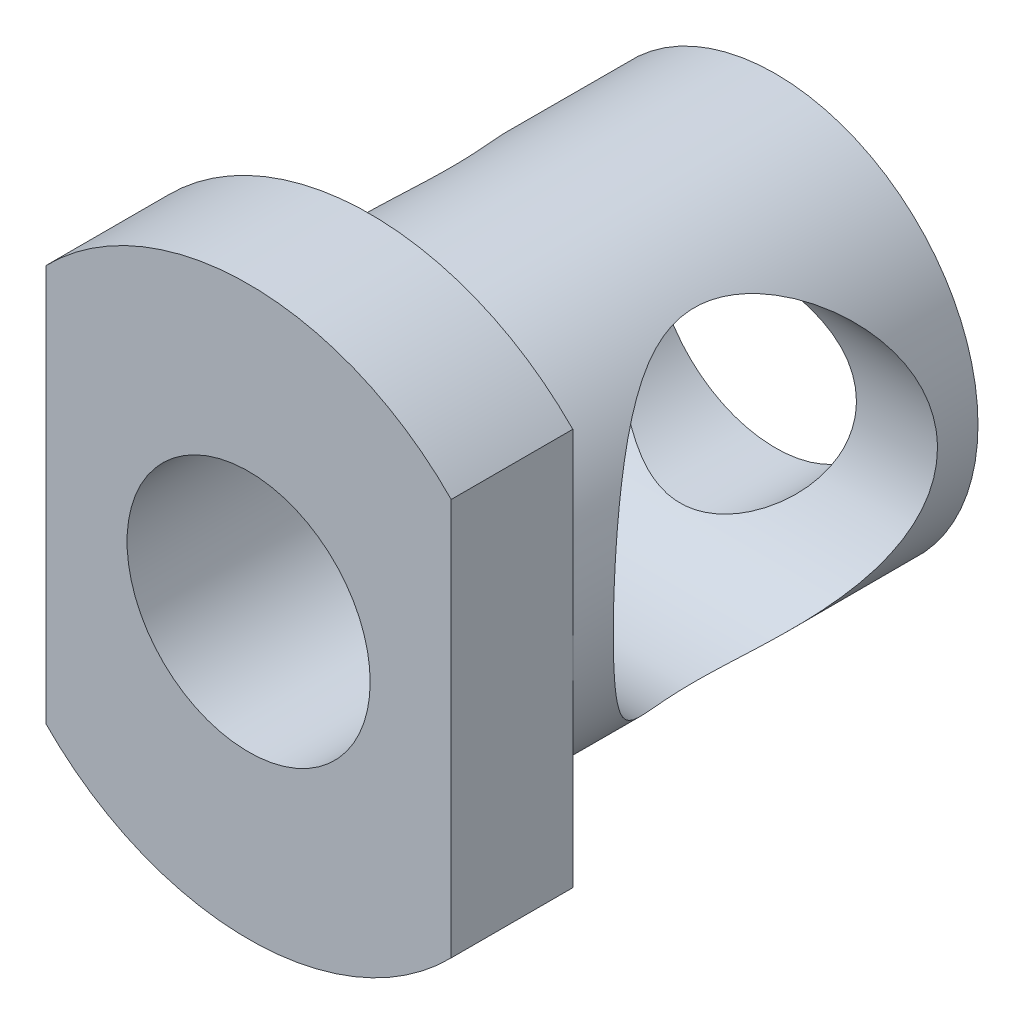
ISO-10303-21;
HEADER;
FILE_DESCRIPTION(('STEP AP214'),'2;1');
FILE_NAME('part.step','',(''),(''),'','','');
FILE_SCHEMA(('AUTOMOTIVE_DESIGN { 1 0 10303 214 1 1 1 1 }'));
ENDSEC;
DATA;
#1=APPLICATION_CONTEXT('core data for automotive mechanical design processes');
#2=APPLICATION_PROTOCOL_DEFINITION('international standard','automotive_design',2000,#1);
#3=PRODUCT_CONTEXT('',#1,'mechanical');
#4=PRODUCT('Part','Part','',(#3));
#5=PRODUCT_RELATED_PRODUCT_CATEGORY('part','',(#4));
#6=PRODUCT_DEFINITION_FORMATION('','',#4);
#7=PRODUCT_DEFINITION_CONTEXT('part definition',#1,'design');
#8=PRODUCT_DEFINITION('design','',#6,#7);
#9=PRODUCT_DEFINITION_SHAPE('','',#8);
#10=(LENGTH_UNIT() NAMED_UNIT(*) SI_UNIT(.MILLI.,.METRE.));
#11=(NAMED_UNIT(*) PLANE_ANGLE_UNIT() SI_UNIT($,.RADIAN.));
#12=(NAMED_UNIT(*) SI_UNIT($,.STERADIAN.) SOLID_ANGLE_UNIT());
#13=UNCERTAINTY_MEASURE_WITH_UNIT(LENGTH_MEASURE(1.E-05),#10,'distance_accuracy_value','');
#14=(GEOMETRIC_REPRESENTATION_CONTEXT(3) GLOBAL_UNCERTAINTY_ASSIGNED_CONTEXT((#13)) GLOBAL_UNIT_ASSIGNED_CONTEXT((#10,
#11,#12)) REPRESENTATION_CONTEXT('',''));
#15=CARTESIAN_POINT('',(0.,0.,0.));
#16=DIRECTION('',(0.,0.,1.));
#17=DIRECTION('',(1.,0.,0.));
#18=AXIS2_PLACEMENT_3D('',#15,#16,#17);
#19=CARTESIAN_POINT('',(0.,0.,0.));
#20=DIRECTION('',(0.,0.,1.));
#21=DIRECTION('',(1.,0.,0.));
#22=AXIS2_PLACEMENT_3D('',#19,#20,#21);
#23=CYLINDRICAL_SURFACE('',#22,1.5);
#24=CARTESIAN_POINT('',(1.5,0.,0.5));
#25=CARTESIAN_POINT('',(1.49999520798798,0.0732207358411543,0.500004598036048));
#26=CARTESIAN_POINT('',(1.4945949756255,0.146561062021485,0.504063544737257));
#27=CARTESIAN_POINT('',(1.47333293658984,0.290936396286467,0.519933927189171));
#28=CARTESIAN_POINT('',(1.45744482834995,0.361965136229004,0.531764853201461));
#29=CARTESIAN_POINT('',(1.41628709071623,0.499234626631249,0.562043250439399));
#30=CARTESIAN_POINT('',(1.39107448643083,0.565501615403737,0.580450480679908));
#31=CARTESIAN_POINT('',(1.33245765581277,0.692422335520753,0.622494432783064));
#32=CARTESIAN_POINT('',(1.29905582580648,0.753077701796332,0.646129624645167));
#33=CARTESIAN_POINT('',(1.22173698840918,0.873465937590145,0.699504554560172));
#34=CARTESIAN_POINT('',(1.17713267066593,0.932593229272032,0.729606914515605));
#35=CARTESIAN_POINT('',(1.08050416263883,1.04302716767671,0.792329821166224));
#36=CARTESIAN_POINT('',(1.02846851720017,1.09432148272226,0.824954219213913));
#37=CARTESIAN_POINT('',(0.906417046721634,1.19837161436623,0.897288763480099));
#38=CARTESIAN_POINT('',(0.834896322878297,1.24930578421204,0.937091451353612));
#39=CARTESIAN_POINT('',(0.682548987633455,1.33861998176348,1.01288555335865));
#40=CARTESIAN_POINT('',(0.601735302999691,1.37701716983077,1.04888213116325));
#41=CARTESIAN_POINT('',(0.460497161323768,1.42880627811788,1.10022844819821));
#42=CARTESIAN_POINT('',(0.402609302871619,1.44625674456539,1.11842248813267));
#43=CARTESIAN_POINT('',(0.283607265215081,1.47420672564844,1.14828405849315));
#44=CARTESIAN_POINT('',(0.22250082212521,1.48472215355267,1.15996652089168));
#45=CARTESIAN_POINT('',(0.097817414469233,1.49812822141445,1.17496240315447));
#46=CARTESIAN_POINT('',(0.034223193275946,1.50094954854207,1.17819973323403));
#47=CARTESIAN_POINT('',(-0.0926149108815734,1.49848213241869,1.17540468223932));
#48=CARTESIAN_POINT('',(-0.155858660087438,1.49319048157349,1.16936897781887));
#49=CARTESIAN_POINT('',(-0.27319134742579,1.47597739291882,1.15032376737481));
#50=CARTESIAN_POINT('',(-0.327536371046184,1.46482486380817,1.13812842940129));
#51=CARTESIAN_POINT('',(-0.433438878720876,1.43705671120733,1.10885807155061));
#52=CARTESIAN_POINT('',(-0.484993627823595,1.42043583681172,1.09177836359231));
#53=CARTESIAN_POINT('',(-0.616256386634149,1.37033064172535,1.04258230705694));
#54=CARTESIAN_POINT('',(-0.693400416643508,1.3328014849398,1.00774350860768));
#55=CARTESIAN_POINT('',(-0.839196523869083,1.24618023314519,0.934667018548041));
#56=CARTESIAN_POINT('',(-0.907827339254659,1.19706004255878,0.896421211138907));
#57=CARTESIAN_POINT('',(-1.03775339040365,1.08651604102135,0.819483276868551));
#58=CARTESIAN_POINT('',(-1.09882060688148,1.02481375526037,0.780804132697607));
#59=CARTESIAN_POINT('',(-1.21026364678116,0.89042252170959,0.707519620190277));
#60=CARTESIAN_POINT('',(-1.26065992023038,0.817755054293757,0.672906517362398));
#61=CARTESIAN_POINT('',(-1.33998079924033,0.677902080454143,0.617202739263569));
#62=CARTESIAN_POINT('',(-1.37118459421578,0.612539870185621,0.594792290549918));
#63=CARTESIAN_POINT('',(-1.42422488046386,0.476352173202087,0.556270955830524));
#64=CARTESIAN_POINT('',(-1.44606723849928,0.405530141063767,0.540156124956484));
#65=CARTESIAN_POINT('',(-1.47925336288644,0.259676232483519,0.515544113640106));
#66=CARTESIAN_POINT('',(-1.49053217893863,0.184621281405943,0.507094070282507));
#67=CARTESIAN_POINT('',(-1.50154959737171,0.0332012397969178,0.498841163405554));
#68=CARTESIAN_POINT('',(-1.50129306869537,-0.0431632843727228,0.499034651545923));
#69=CARTESIAN_POINT('',(-1.48988913072681,-0.186804217329625,0.507574528241266));
#70=CARTESIAN_POINT('',(-1.47983946311133,-0.254222327546132,0.515099133995989));
#71=CARTESIAN_POINT('',(-1.45102621999213,-0.386110670609117,0.536486797984122));
#72=CARTESIAN_POINT('',(-1.43226079031059,-0.45058027298726,0.550351204927381));
#73=CARTESIAN_POINT('',(-1.3861124694069,-0.577416779689769,0.584001693166867));
#74=CARTESIAN_POINT('',(-1.3584488185726,-0.639629172536139,0.603979497098065));
#75=CARTESIAN_POINT('',(-1.29582754457441,-0.758518527043073,0.648330145880373));
#76=CARTESIAN_POINT('',(-1.26086891236027,-0.815194721336402,0.672703598679324));
#77=CARTESIAN_POINT('',(-1.17821675358944,-0.931511626319036,0.728808531135008));
#78=CARTESIAN_POINT('',(-1.12937146056255,-0.990066762698701,0.761089049749631));
#79=CARTESIAN_POINT('',(-1.02399124741161,-1.09871974855854,0.827610471252152));
#80=CARTESIAN_POINT('',(-0.967439300306643,-1.14879830469577,0.86185561492605));
#81=CARTESIAN_POINT('',(-0.835850119038825,-1.24877541075626,0.936308717085034));
#82=CARTESIAN_POINT('',(-0.759342438507699,-1.29683043648705,0.976412814798995));
#83=CARTESIAN_POINT('',(-0.596639922027548,-1.37923235998282,1.05059408651549));
#84=CARTESIAN_POINT('',(-0.510474878091427,-1.41362000515519,1.08468900429031));
#85=CARTESIAN_POINT('',(-0.364585551125526,-1.45615734256767,1.12881122191417));
#86=CARTESIAN_POINT('',(-0.307608873597619,-1.46931009512996,1.14304188175435));
#87=CARTESIAN_POINT('',(-0.19129295301682,-1.48891522181906,1.16457943896989));
#88=CARTESIAN_POINT('',(-0.131959293197749,-1.4953825519924,1.17190178779767));
#89=CARTESIAN_POINT('',(-0.0121709201886724,-1.50115320209064,1.17842398207791));
#90=CARTESIAN_POINT('',(0.0482879430095713,-1.50042015325262,1.17758259315025));
#91=CARTESIAN_POINT('',(0.168056838752156,-1.49176883838219,1.16783551456334));
#92=CARTESIAN_POINT('',(0.227365287897257,-1.48384130024585,1.15891941842516));
#93=CARTESIAN_POINT('',(0.355914571410799,-1.45893841819723,1.13182651202227));
#94=CARTESIAN_POINT('',(0.424497180132773,-1.44036567954111,1.11205294049357));
#95=CARTESIAN_POINT('',(0.556534848830484,-1.39469627266119,1.0661703661459));
#96=CARTESIAN_POINT('',(0.619976442038188,-1.3675780729773,1.0400453985307));
#97=CARTESIAN_POINT('',(0.762520630486333,-1.29498918933643,0.974835226711764));
#98=CARTESIAN_POINT('',(0.839421582755753,-1.2464154206597,0.934397968088953));
#99=CARTESIAN_POINT('',(0.983126044977563,-1.13650718465936,0.852864898187272));
#100=CARTESIAN_POINT('',(1.04992046594485,-1.07516134758577,0.811768530457776));
#101=CARTESIAN_POINT('',(1.17283184228333,-0.939627144937892,0.732710110602067));
#102=CARTESIAN_POINT('',(1.22885631937719,-0.865337161562861,0.694776662889283));
#103=CARTESIAN_POINT('',(1.32722305114535,-0.705159098936205,0.626427103319033));
#104=CARTESIAN_POINT('',(1.36959797457251,-0.619299420401796,0.595993084070413));
#105=CARTESIAN_POINT('',(1.42779942098571,-0.464840290356456,0.553632953759523));
#106=CARTESIAN_POINT('',(1.44776673137617,-0.398553614774734,0.53889677500282));
#107=CARTESIAN_POINT('',(1.47841790261149,-0.262841610392762,0.516162600297624));
#108=CARTESIAN_POINT('',(1.48912769024996,-0.193425623834908,0.50814578789106));
#109=CARTESIAN_POINT('',(1.49660469421435,-0.102963309861891,0.50254528293691));
#110=CARTESIAN_POINT('',(1.49787627748942,-0.0824069459941252,0.501592385679202));
#111=CARTESIAN_POINT('',(1.49957467323097,-0.041236889624379,0.500319045768617));
#112=CARTESIAN_POINT('',(1.50000134970737,-0.0206231884283885,0.499998704927467));
#113=CARTESIAN_POINT('',(1.5,0.,0.5));
#114=B_SPLINE_CURVE_WITH_KNOTS('',3,(#24,#25,#26,#27,#28,#29,#30,#31,#32,#33,#34,#35,#36,#37,
#38,#39,#40,#41,#42,#43,#44,#45,#46,#47,#48,#49,#50,#51,#52,#53,#54,#55,#56,#57,#58,#59,#60,#61,
#62,#63,#64,#65,#66,#67,#68,#69,#70,#71,#72,#73,#74,#75,#76,#77,#78,#79,#80,#81,#82,#83,#84,#85,
#86,#87,#88,#89,#90,#91,#92,#93,#94,#95,#96,#97,#98,#99,#100,#101,#102,#103,#104,#105,#106,#107,
#108,#109,#110,#111,#112,#113),.UNSPECIFIED.,.T.,.F.,(4,2,2,2,2,2,2,2,2,2,2,2,2,2,2,2,2,2,2,2,2,
2,2,2,2,2,2,2,2,2,2,2,2,2,2,2,2,2,2,2,2,2,2,2,4),(0.,0.219571786572042,0.439696319423244,
0.658496333573381,0.877232398849293,1.1162243131743,1.35558868405162,1.64360015887451,
1.93121574056507,2.11999518529901,2.3083399319529,2.49837587621257,2.6884799430021,
2.85826890162709,3.0282213760064,3.3044933180591,3.58144192357889,3.8653588393809,
4.14872662493691,4.37526505006389,4.60166129643117,4.82944058166898,5.05712372466613,
5.26191187011994,5.46674360185812,5.6788043948368,5.89089453977541,6.13840382081868,
6.38646908985452,6.68168596015947,6.97601595850112,7.15589161422933,7.33536399114208,
7.51574333854741,7.69635548563854,7.91639670960134,8.13699685139921,8.43412246655768,
8.73151372390893,9.0313544949265,9.33047220273164,9.5419569754163,9.75284752283256,
9.81468166878711,9.87652576630966),.UNSPECIFIED.);
#115=CARTESIAN_POINT('',(1.5,0.,0.5));
#116=VERTEX_POINT('',#115);
#117=EDGE_CURVE('E44',#116,#116,#114,.T.);
#118=ORIENTED_EDGE('',*,*,#117,.T.);
#119=EDGE_LOOP('',(#118));
#120=FACE_BOUND('',#119,.T.);
#121=CARTESIAN_POINT('',(0.,0.,0.));
#122=DIRECTION('',(0.,0.,1.));
#123=DIRECTION('',(1.,0.,0.));
#124=AXIS2_PLACEMENT_3D('',#121,#122,#123);
#125=CIRCLE('',#124,1.5);
#126=CARTESIAN_POINT('',(1.5,0.,0.));
#127=VERTEX_POINT('',#126);
#128=EDGE_CURVE('E159',#127,#127,#125,.T.);
#129=ORIENTED_EDGE('',*,*,#128,.F.);
#130=EDGE_LOOP('',(#129));
#131=FACE_BOUND('',#130,.T.);
#132=ADVANCED_FACE('F39',(#120,#131),#23,.F.);
#133=CARTESIAN_POINT('',(0.,0.,5.));
#134=DIRECTION('',(0.,0.,-1.));
#135=DIRECTION('',(-1.,0.,0.));
#136=AXIS2_PLACEMENT_3D('',#133,#134,#135);
#137=CYLINDRICAL_SURFACE('',#136,2.5);
#138=CARTESIAN_POINT('',(-2.5,0.,4.5));
#139=CARTESIAN_POINT('',(-2.49999264947401,-0.0959968964388691,4.49999242056707));
#140=CARTESIAN_POINT('',(-2.49441368411908,-0.192133192964673,4.49303057133644));
#141=CARTESIAN_POINT('',(-2.47259269360604,-0.381319365477407,4.46565005995827));
#142=CARTESIAN_POINT('',(-2.45632708000382,-0.474361934321336,4.44520162873807));
#143=CARTESIAN_POINT('',(-2.4146672181517,-0.654094916824507,4.39232172110493));
#144=CARTESIAN_POINT('',(-2.38933120144167,-0.740821698128048,4.35996664856862));
#145=CARTESIAN_POINT('',(-2.331360109966,-0.906926323692543,4.28488265652265));
#146=CARTESIAN_POINT('',(-2.29872501207751,-0.986304144671504,4.24215370414941));
#147=CARTESIAN_POINT('',(-2.21575664728951,-1.16318123656703,4.13137163496894));
#148=CARTESIAN_POINT('',(-2.16321748603216,-1.25736767952115,4.05968108482594));
#149=CARTESIAN_POINT('',(-2.05292192603027,-1.43041367827883,3.9027219342605));
#150=CARTESIAN_POINT('',(-1.99515072200505,-1.50922761533153,3.81741424649663));
#151=CARTESIAN_POINT('',(-1.87856001629835,-1.6521591895554,3.63322601592733));
#152=CARTESIAN_POINT('',(-1.81973830902028,-1.71602638457222,3.53415322702388));
#153=CARTESIAN_POINT('',(-1.7088210988299,-1.82646834413604,3.32346121749581));
#154=CARTESIAN_POINT('',(-1.65670347089169,-1.87310099386401,3.21188566611201));
#155=CARTESIAN_POINT('',(-1.58835652300927,-1.93086043771819,3.02612104832302));
#156=CARTESIAN_POINT('',(-1.56628727770188,-1.94865475820658,2.95618826201971));
#157=CARTESIAN_POINT('',(-1.53069889155832,-1.97673396798331,2.81278731587953));
#158=CARTESIAN_POINT('',(-1.51715874179739,-1.98703731881776,2.739328326475));
#159=CARTESIAN_POINT('',(-1.50084234061103,-1.99939840142554,2.58980748112896));
#160=CARTESIAN_POINT('',(-1.49816096926555,-2.00138345613423,2.51372851517921));
#161=CARTESIAN_POINT('',(-1.50439962302809,-1.99669481699685,2.36229510796726));
#162=CARTESIAN_POINT('',(-1.51332946660241,-1.99001379511087,2.2869413342337));
#163=CARTESIAN_POINT('',(-1.54320721299969,-1.9669530271194,2.12777769738727));
#164=CARTESIAN_POINT('',(-1.56581842049528,-1.94921808205621,2.044491993946));
#165=CARTESIAN_POINT('',(-1.61997459936279,-1.90444547348848,1.88346444046297));
#166=CARTESIAN_POINT('',(-1.6515459819864,-1.87738025642251,1.80573984346018));
#167=CARTESIAN_POINT('',(-1.73656116159415,-1.79974102194077,1.61933789395902));
#168=CARTESIAN_POINT('',(-1.79313372968153,-1.74414886595504,1.51419730169582));
#169=CARTESIAN_POINT('',(-1.90913780060687,-1.61638467497537,1.31628332220067));
#170=CARTESIAN_POINT('',(-1.96857337048937,-1.54418846902464,1.22352827915646));
#171=CARTESIAN_POINT('',(-2.08612751968448,-1.38145818326396,1.04872522859493));
#172=CARTESIAN_POINT('',(-2.14416889260779,-1.29048701026967,0.96702807769423));
#173=CARTESIAN_POINT('',(-2.25171871494994,-1.09198491072667,0.819900500565693));
#174=CARTESIAN_POINT('',(-2.3012499182245,-0.98449964520108,0.754426483882768));
#175=CARTESIAN_POINT('',(-2.37424585643318,-0.787777814380561,0.659437152590106));
#176=CARTESIAN_POINT('',(-2.40111071224171,-0.702177727329208,0.624995495560929));
#177=CARTESIAN_POINT('',(-2.44597564111416,-0.524913923737155,0.567873549012029));
#178=CARTESIAN_POINT('',(-2.46398239496913,-0.433254836272287,0.545184395054523));
#179=CARTESIAN_POINT('',(-2.48970335685206,-0.24571323384493,0.512861453064212));
#180=CARTESIAN_POINT('',(-2.49736378633666,-0.149811307212619,0.503295875255045));
#181=CARTESIAN_POINT('',(-2.50148682701864,0.0426080028675152,0.498140951023711));
#182=CARTESIAN_POINT('',(-2.49795152409061,0.13912526832796,0.50254900117794));
#183=CARTESIAN_POINT('',(-2.48076858642945,0.32174667415546,0.524082816247683));
#184=CARTESIAN_POINT('',(-2.46796352405063,0.408060891756563,0.540149175139013));
#185=CARTESIAN_POINT('',(-2.43417513213473,0.576335674228718,0.582872181101561));
#186=CARTESIAN_POINT('',(-2.41318937553438,0.658294938856938,0.609531971096621));
#187=CARTESIAN_POINT('',(-2.36289849431328,0.821235877548907,0.674150371783927));
#188=CARTESIAN_POINT('',(-2.33315912736867,0.901843619419051,0.712705785956363));
#189=CARTESIAN_POINT('',(-2.26783622722139,1.0554100044833,0.798862151632789));
#190=CARTESIAN_POINT('',(-2.23225240258423,1.12836826593788,0.846463554234547));
#191=CARTESIAN_POINT('',(-2.14993687522397,1.27925237569143,0.959224318296871));
#192=CARTESIAN_POINT('',(-2.1023696976822,1.35550718978129,1.02600169048299));
#193=CARTESIAN_POINT('',(-2.0044349795202,1.4965368759753,1.16938696137098));
#194=CARTESIAN_POINT('',(-1.95405970991097,1.56127777727366,1.24602283683883));
#195=CARTESIAN_POINT('',(-1.87374135317135,1.65568487930787,1.37643444323659));
#196=CARTESIAN_POINT('',(-1.84354743685463,1.68913741792652,1.42736059075333));
#197=CARTESIAN_POINT('',(-1.78435415521131,1.75155001920543,1.53262226142359));
#198=CARTESIAN_POINT('',(-1.75535542951891,1.78050769868975,1.58695957188079));
#199=CARTESIAN_POINT('',(-1.69983828792997,1.83358089959817,1.69887484028166));
#200=CARTESIAN_POINT('',(-1.67331090774834,1.85771431687654,1.75643976724368));
#201=CARTESIAN_POINT('',(-1.62410209867689,1.90088481958635,1.87500897850398));
#202=CARTESIAN_POINT('',(-1.60141789380427,1.9199255893155,1.93601073751953));
#203=CARTESIAN_POINT('',(-1.5601942022258,1.95360165889083,2.06608672423779));
#204=CARTESIAN_POINT('',(-1.54209716714775,1.96779559724999,2.13542266494034));
#205=CARTESIAN_POINT('',(-1.5149337159379,1.98878905619367,2.27683761273805));
#206=CARTESIAN_POINT('',(-1.50584452307524,1.99560723074758,2.34890922045048));
#207=CARTESIAN_POINT('',(-1.49824736779721,2.00132058716546,2.49434870546407));
#208=CARTESIAN_POINT('',(-1.49979625918437,2.00017319779789,2.56772145415415));
#209=CARTESIAN_POINT('',(-1.51330771695992,1.98996519544204,2.7129841930231));
#210=CARTESIAN_POINT('',(-1.52528679347386,1.98089203653787,2.7848716473261));
#211=CARTESIAN_POINT('',(-1.56207076756082,1.95207745752715,2.94460677434455));
#212=CARTESIAN_POINT('',(-1.58949258419369,1.93009230408643,3.03142308249112));
#213=CARTESIAN_POINT('',(-1.65288907642406,1.87608177217432,3.19863347868963));
#214=CARTESIAN_POINT('',(-1.68888887211292,1.84402681542564,3.27900776003671));
#215=CARTESIAN_POINT('',(-1.75491158724438,1.78094746311468,3.41217772204615));
#216=CARTESIAN_POINT('',(-1.78388907325007,1.7520236319041,3.46651918151828));
#217=CARTESIAN_POINT('',(-1.84307948739001,1.68964733782463,3.57183822981725));
#218=CARTESIAN_POINT('',(-1.87329286211508,1.65619322765904,3.62281458495114));
#219=CARTESIAN_POINT('',(-1.96437997758119,1.54918435570711,3.77077940329881));
#220=CARTESIAN_POINT('',(-2.02569808481401,1.4689854164051,3.86279868666247));
#221=CARTESIAN_POINT('',(-2.14418278787112,1.29001718858432,4.03338946483076));
#222=CARTESIAN_POINT('',(-2.201284919641,1.19101966157649,4.11177022423678));
#223=CARTESIAN_POINT('',(-2.27874650804526,1.02998399899548,4.21557672941679));
#224=CARTESIAN_POINT('',(-2.30318868109328,0.974255400199706,4.24786844413511));
#225=CARTESIAN_POINT('',(-2.34866115465601,0.858854828628056,4.30736810096138));
#226=CARTESIAN_POINT('',(-2.36969354228912,0.799185299805375,4.3345791544845));
#227=CARTESIAN_POINT('',(-2.41420905511498,0.655037739424259,4.3917800598956));
#228=CARTESIAN_POINT('',(-2.43602892887627,0.569110239590131,4.41948267180093));
#229=CARTESIAN_POINT('',(-2.47058864976841,0.392713097427734,4.4631576733877));
#230=CARTESIAN_POINT('',(-2.48335227816872,0.30225602410315,4.47916078877459));
#231=CARTESIAN_POINT('',(-2.49405378309104,0.175880930919922,4.4925630255603));
#232=CARTESIAN_POINT('',(-2.49627918763429,0.140808552821281,4.49534737874577));
#233=CARTESIAN_POINT('',(-2.49925381017899,0.0704970748918324,4.49906746352746));
#234=CARTESIAN_POINT('',(-2.50000269971647,0.0352579397117364,4.50000278378988));
#235=CARTESIAN_POINT('',(-2.5,0.,4.5));
#236=B_SPLINE_CURVE_WITH_KNOTS('',3,(#138,#139,#140,#141,#142,#143,#144,#145,#146,#147,#148,
#149,#150,#151,#152,#153,#154,#155,#156,#157,#158,#159,#160,#161,#162,#163,#164,#165,#166,#167,
#168,#169,#170,#171,#172,#173,#174,#175,#176,#177,#178,#179,#180,#181,#182,#183,#184,#185,#186,
#187,#188,#189,#190,#191,#192,#193,#194,#195,#196,#197,#198,#199,#200,#201,#202,#203,#204,#205,
#206,#207,#208,#209,#210,#211,#212,#213,#214,#215,#216,#217,#218,#219,#220,#221,#222,#223,#224,
#225,#226,#227,#228,#229,#230,#231,#232,#233,#234,#235),.UNSPECIFIED.,.T.,.F.,(4,2,2,2,2,2,2,2,
2,2,2,2,2,2,2,2,2,2,2,2,2,2,2,2,2,2,2,2,2,2,2,2,2,2,2,2,2,2,2,2,2,2,2,2,2,2,2,2,4),(0.,
0.287836605992208,0.576310692639342,0.862965057250605,1.14962032997081,1.53607888200101,
1.92366738187851,2.31734741765481,2.70969292925127,2.9353448634113,3.16043877408111,
3.38749528500759,3.61474392028823,3.87758630032011,4.14121163495705,4.53425748188301,
4.92787915886674,5.33198173288419,5.73498644040676,6.02213978124802,6.30907621738868,
6.59749843639964,6.88586692268771,7.15087004938159,7.41595185759573,7.69742753051566,
7.97891724351349,8.31365537249325,8.64936529970902,8.85316560745906,9.0570736038085,
9.26021055202078,9.46320013996581,9.68152133432596,9.89928907450684,10.1182215471168,
10.3375012031536,10.616933053181,10.8971934831173,11.1010640012511,11.3050088506911,
11.7129165318148,12.1261363563906,12.3324811048119,12.5386990694968,12.8161540735934,
13.0928777702216,13.1985714874516,13.3042887145431),.UNSPECIFIED.);
#237=CARTESIAN_POINT('',(-2.5,0.,4.5));
#238=VERTEX_POINT('',#237);
#239=EDGE_CURVE('E151',#238,#238,#236,.T.);
#240=ORIENTED_EDGE('',*,*,#239,.T.);
#241=EDGE_LOOP('',(#240));
#242=FACE_BOUND('',#241,.T.);
#243=CARTESIAN_POINT('',(2.5,0.,0.5));
#244=CARTESIAN_POINT('',(2.49999264947401,-0.0959968964388695,0.500007579432929));
#245=CARTESIAN_POINT('',(2.49441368411908,-0.192133192964674,0.506969428663558));
#246=CARTESIAN_POINT('',(2.47259269360604,-0.381319365477408,0.534349940041729));
#247=CARTESIAN_POINT('',(2.45632708000382,-0.474361934321336,0.554798371261927));
#248=CARTESIAN_POINT('',(2.4146672181517,-0.654094916824507,0.607678278895069));
#249=CARTESIAN_POINT('',(2.38933120144167,-0.740821698128048,0.640033351431378));
#250=CARTESIAN_POINT('',(2.331360109966,-0.906926323692543,0.715117343477346));
#251=CARTESIAN_POINT('',(2.29872501207751,-0.986304144671505,0.757846295850589));
#252=CARTESIAN_POINT('',(2.21575664728951,-1.16318123656703,0.868628365031063));
#253=CARTESIAN_POINT('',(2.16321748603216,-1.25736767952115,0.940318915174064));
#254=CARTESIAN_POINT('',(2.05292192603027,-1.43041367827883,1.0972780657395));
#255=CARTESIAN_POINT('',(1.99515072200505,-1.50922761533153,1.18258575350337));
#256=CARTESIAN_POINT('',(1.87856001629835,-1.6521591895554,1.36677398407267));
#257=CARTESIAN_POINT('',(1.81973830902028,-1.71602638457222,1.46584677297612));
#258=CARTESIAN_POINT('',(1.7088210988299,-1.82646834413604,1.67653878250419));
#259=CARTESIAN_POINT('',(1.65670347089169,-1.87310099386401,1.78811433388799));
#260=CARTESIAN_POINT('',(1.58835652300927,-1.93086043771819,1.97387895167698));
#261=CARTESIAN_POINT('',(1.56628727770188,-1.94865475820658,2.04381173798029));
#262=CARTESIAN_POINT('',(1.53069889155832,-1.97673396798331,2.18721268412047));
#263=CARTESIAN_POINT('',(1.51715874179739,-1.98703731881776,2.260671673525));
#264=CARTESIAN_POINT('',(1.50084234061103,-1.99939840142554,2.41019251887104));
#265=CARTESIAN_POINT('',(1.49816096926555,-2.00138345613423,2.48627148482079));
#266=CARTESIAN_POINT('',(1.50439962302809,-1.99669481699685,2.63770489203274));
#267=CARTESIAN_POINT('',(1.51332946660241,-1.99001379511087,2.7130586657663));
#268=CARTESIAN_POINT('',(1.54320721299969,-1.9669530271194,2.87222230261273));
#269=CARTESIAN_POINT('',(1.56581842049528,-1.94921808205621,2.955508006054));
#270=CARTESIAN_POINT('',(1.61997459936279,-1.90444547348848,3.11653555953703));
#271=CARTESIAN_POINT('',(1.6515459819864,-1.87738025642251,3.19426015653982));
#272=CARTESIAN_POINT('',(1.73656116159415,-1.79974102194077,3.38066210604098));
#273=CARTESIAN_POINT('',(1.79313372968153,-1.74414886595504,3.48580269830418));
#274=CARTESIAN_POINT('',(1.90913780060687,-1.61638467497537,3.68371667779933));
#275=CARTESIAN_POINT('',(1.96857337048937,-1.54418846902465,3.77647172084354));
#276=CARTESIAN_POINT('',(2.08612751968448,-1.38145818326396,3.95127477140507));
#277=CARTESIAN_POINT('',(2.14416889260779,-1.29048701026967,4.03297192230577));
#278=CARTESIAN_POINT('',(2.25171871494994,-1.09198491072667,4.18009949943431));
#279=CARTESIAN_POINT('',(2.3012499182245,-0.98449964520108,4.24557351611723));
#280=CARTESIAN_POINT('',(2.37424585643318,-0.78777781438056,4.34056284740989));
#281=CARTESIAN_POINT('',(2.40111071224171,-0.702177727329207,4.37500450443907));
#282=CARTESIAN_POINT('',(2.44597564111416,-0.524913923737154,4.43212645098797));
#283=CARTESIAN_POINT('',(2.46398239496913,-0.433254836272285,4.45481560494548));
#284=CARTESIAN_POINT('',(2.48970335685206,-0.245713233844928,4.48713854693579));
#285=CARTESIAN_POINT('',(2.49736378633666,-0.149811307212618,4.49670412474496));
#286=CARTESIAN_POINT('',(2.50148682701864,0.0426080028675171,4.50185904897629));
#287=CARTESIAN_POINT('',(2.49795152409061,0.139125268327962,4.49745099882206));
#288=CARTESIAN_POINT('',(2.48076858642945,0.321746674155462,4.47591718375232));
#289=CARTESIAN_POINT('',(2.46796352405063,0.408060891756565,4.45985082486099));
#290=CARTESIAN_POINT('',(2.43417513213473,0.57633567422872,4.41712781889844));
#291=CARTESIAN_POINT('',(2.41318937553438,0.65829493885694,4.39046802890338));
#292=CARTESIAN_POINT('',(2.36289849431328,0.821235877548909,4.32584962821607));
#293=CARTESIAN_POINT('',(2.33315912736867,0.901843619419053,4.28729421404364));
#294=CARTESIAN_POINT('',(2.26783622722139,1.05541000448331,4.20113784836721));
#295=CARTESIAN_POINT('',(2.23225240258423,1.12836826593788,4.15353644576545));
#296=CARTESIAN_POINT('',(2.14993687522397,1.27925237569143,4.04077568170313));
#297=CARTESIAN_POINT('',(2.1023696976822,1.35550718978129,3.973998309517));
#298=CARTESIAN_POINT('',(2.00443497952019,1.4965368759753,3.83061303862902));
#299=CARTESIAN_POINT('',(1.95405970991097,1.56127777727367,3.75397716316117));
#300=CARTESIAN_POINT('',(1.87374135317135,1.65568487930787,3.62356555676341));
#301=CARTESIAN_POINT('',(1.84354743685463,1.68913741792652,3.57263940924667));
#302=CARTESIAN_POINT('',(1.78435415521131,1.75155001920543,3.46737773857641));
#303=CARTESIAN_POINT('',(1.75535542951891,1.78050769868976,3.41304042811921));
#304=CARTESIAN_POINT('',(1.69983828792997,1.83358089959817,3.30112515971834));
#305=CARTESIAN_POINT('',(1.67331090774834,1.85771431687654,3.24356023275631));
#306=CARTESIAN_POINT('',(1.62410209867688,1.90088481958635,3.12499102149602));
#307=CARTESIAN_POINT('',(1.60141789380427,1.9199255893155,3.06398926248046));
#308=CARTESIAN_POINT('',(1.56019420222579,1.95360165889083,2.9339132757622));
#309=CARTESIAN_POINT('',(1.54209716714775,1.96779559724999,2.86457733505965));
#310=CARTESIAN_POINT('',(1.5149337159379,1.98878905619367,2.72316238726195));
#311=CARTESIAN_POINT('',(1.50584452307524,1.99560723074758,2.65109077954952));
#312=CARTESIAN_POINT('',(1.49824736779721,2.00132058716546,2.50565129453592));
#313=CARTESIAN_POINT('',(1.49979625918437,2.00017319779789,2.43227854584584));
#314=CARTESIAN_POINT('',(1.51330771695992,1.98996519544204,2.2870158069769));
#315=CARTESIAN_POINT('',(1.52528679347386,1.98089203653787,2.2151283526739));
#316=CARTESIAN_POINT('',(1.56207076756083,1.95207745752715,2.05539322565545));
#317=CARTESIAN_POINT('',(1.5894925841937,1.93009230408642,1.96857691750888));
#318=CARTESIAN_POINT('',(1.65288907642407,1.87608177217432,1.80136652131037));
#319=CARTESIAN_POINT('',(1.68888887211292,1.84402681542564,1.72099223996329));
#320=CARTESIAN_POINT('',(1.75491158724438,1.78094746311468,1.58782227795385));
#321=CARTESIAN_POINT('',(1.78388907325007,1.7520236319041,1.53348081848171));
#322=CARTESIAN_POINT('',(1.84307948739001,1.68964733782463,1.42816177018274));
#323=CARTESIAN_POINT('',(1.87329286211508,1.65619322765903,1.37718541504885));
#324=CARTESIAN_POINT('',(1.96437997758119,1.54918435570711,1.22922059670119));
#325=CARTESIAN_POINT('',(2.02569808481402,1.4689854164051,1.13720131333753));
#326=CARTESIAN_POINT('',(2.14418278787112,1.29001718858431,0.966610535169241));
#327=CARTESIAN_POINT('',(2.201284919641,1.19101966157649,0.888229775763216));
#328=CARTESIAN_POINT('',(2.27874650804526,1.02998399899548,0.784423270583211));
#329=CARTESIAN_POINT('',(2.30318868109328,0.974255400199702,0.752131555864882));
#330=CARTESIAN_POINT('',(2.34866115465601,0.858854828628051,0.692631899038618));
#331=CARTESIAN_POINT('',(2.36969354228912,0.799185299805369,0.665420845515496));
#332=CARTESIAN_POINT('',(2.41420905511498,0.655037739424252,0.608219940104394));
#333=CARTESIAN_POINT('',(2.43602892887627,0.569110239590124,0.580517328199072));
#334=CARTESIAN_POINT('',(2.47058864976841,0.392713097427726,0.536842326612297));
#335=CARTESIAN_POINT('',(2.48335227816872,0.302256024103142,0.520839211225405));
#336=CARTESIAN_POINT('',(2.49405378309104,0.175880930919915,0.507436974439696));
#337=CARTESIAN_POINT('',(2.49627918763429,0.140808552821275,0.504652621254229));
#338=CARTESIAN_POINT('',(2.49925381017899,0.0704970748918288,0.500932536472541));
#339=CARTESIAN_POINT('',(2.50000269971647,0.0352579397117344,0.499997216210116));
#340=CARTESIAN_POINT('',(2.5,0.,0.5));
#341=B_SPLINE_CURVE_WITH_KNOTS('',3,(#243,#244,#245,#246,#247,#248,#249,#250,#251,#252,#253,
#254,#255,#256,#257,#258,#259,#260,#261,#262,#263,#264,#265,#266,#267,#268,#269,#270,#271,#272,
#273,#274,#275,#276,#277,#278,#279,#280,#281,#282,#283,#284,#285,#286,#287,#288,#289,#290,#291,
#292,#293,#294,#295,#296,#297,#298,#299,#300,#301,#302,#303,#304,#305,#306,#307,#308,#309,#310,
#311,#312,#313,#314,#315,#316,#317,#318,#319,#320,#321,#322,#323,#324,#325,#326,#327,#328,#329,
#330,#331,#332,#333,#334,#335,#336,#337,#338,#339,#340),.UNSPECIFIED.,.T.,.F.,(4,2,2,2,2,2,2,2,
2,2,2,2,2,2,2,2,2,2,2,2,2,2,2,2,2,2,2,2,2,2,2,2,2,2,2,2,2,2,2,2,2,2,2,2,2,2,2,2,4),(0.,
0.287836605992209,0.576310692639342,0.862965057250605,1.14962032997081,1.53607888200101,
1.92366738187851,2.31734741765481,2.70969292925127,2.9353448634113,3.1604387740811,
3.38749528500759,3.61474392028823,3.87758630032011,4.14121163495705,4.534257481883,
4.92787915886674,5.33198173288419,5.73498644040676,6.02213978124802,6.30907621738868,
6.59749843639964,6.88586692268771,7.15087004938159,7.41595185759573,7.69742753051566,
7.9789172435135,8.31365537249325,8.64936529970902,8.85316560745906,9.05707360380851,
9.26021055202079,9.46320013996582,9.68152133432596,9.89928907450684,10.1182215471168,
10.3375012031536,10.616933053181,10.8971934831173,11.1010640012511,11.3050088506911,
11.7129165318148,12.1261363563906,12.3324811048119,12.5386990694968,12.8161540735934,
13.0928777702216,13.1985714874516,13.3042887145431),.UNSPECIFIED.);
#342=CARTESIAN_POINT('',(2.5,0.,0.5));
#343=VERTEX_POINT('',#342);
#344=EDGE_CURVE('E145',#343,#343,#341,.T.);
#345=ORIENTED_EDGE('',*,*,#344,.T.);
#346=EDGE_LOOP('',(#345));
#347=FACE_BOUND('',#346,.T.);
#348=CARTESIAN_POINT('',(0.,0.,5.));
#349=DIRECTION('',(0.,0.,1.));
#350=DIRECTION('',(1.,0.,0.));
#351=AXIS2_PLACEMENT_3D('',#348,#349,#350);
#352=CIRCLE('',#351,2.5);
#353=CARTESIAN_POINT('',(2.5,0.,5.));
#354=VERTEX_POINT('',#353);
#355=CARTESIAN_POINT('',(-2.5,0.,5.));
#356=VERTEX_POINT('',#355);
#357=EDGE_CURVE('E11',#354,#356,#352,.T.);
#358=ORIENTED_EDGE('',*,*,#357,.F.);
#359=EDGE_CURVE('E55',#356,#354,#352,.T.);
#360=ORIENTED_EDGE('',*,*,#359,.F.);
#361=EDGE_LOOP('',(#358,#360));
#362=FACE_BOUND('',#361,.T.);
#363=CARTESIAN_POINT('',(0.,0.,0.));
#364=DIRECTION('',(0.,0.,1.));
#365=DIRECTION('',(1.,0.,0.));
#366=AXIS2_PLACEMENT_3D('',#363,#364,#365);
#367=CIRCLE('',#366,2.5);
#368=CARTESIAN_POINT('',(2.5,0.,0.));
#369=VERTEX_POINT('',#368);
#370=EDGE_CURVE('E118',#369,#369,#367,.T.);
#371=ORIENTED_EDGE('',*,*,#370,.T.);
#372=EDGE_LOOP('',(#371));
#373=FACE_BOUND('',#372,.T.);
#374=ADVANCED_FACE('F41',(#242,#347,#362,#373),#137,.T.);
#375=CARTESIAN_POINT('',(0.,0.,0.));
#376=DIRECTION('',(0.,0.,1.));
#377=DIRECTION('',(1.,0.,0.));
#378=AXIS2_PLACEMENT_3D('',#375,#376,#377);
#379=PLANE('',#378);
#380=ORIENTED_EDGE('',*,*,#128,.T.);
#381=EDGE_LOOP('',(#380));
#382=FACE_BOUND('',#381,.T.);
#383=ORIENTED_EDGE('',*,*,#370,.F.);
#384=EDGE_LOOP('',(#383));
#385=FACE_BOUND('',#384,.T.);
#386=ADVANCED_FACE('F213',(#382,#385),#379,.F.);
#387=CARTESIAN_POINT('',(0.,0.,5.));
#388=DIRECTION('',(0.,0.,1.));
#389=DIRECTION('',(1.,0.,0.));
#390=AXIS2_PLACEMENT_3D('',#387,#388,#389);
#391=PLANE('',#390);
#392=DIRECTION('',(0.,1.,0.));
#393=VECTOR('',#392,1.);
#394=CARTESIAN_POINT('',(2.5,2.44948974278318,5.));
#395=LINE('',#394,#393);
#396=CARTESIAN_POINT('',(2.5,2.44948974278318,5.));
#397=VERTEX_POINT('',#396);
#398=EDGE_CURVE('E180',#354,#397,#395,.T.);
#399=ORIENTED_EDGE('',*,*,#398,.F.);
#400=ORIENTED_EDGE('',*,*,#357,.T.);
#401=DIRECTION('',(0.,-1.,0.));
#402=VECTOR('',#401,1.);
#403=CARTESIAN_POINT('',(-2.5,2.44948974278318,5.));
#404=LINE('',#403,#402);
#405=CARTESIAN_POINT('',(-2.5,2.44948974278318,5.));
#406=VERTEX_POINT('',#405);
#407=EDGE_CURVE('E174',#406,#356,#404,.T.);
#408=ORIENTED_EDGE('',*,*,#407,.F.);
#409=CARTESIAN_POINT('',(0.,0.,5.));
#410=DIRECTION('',(0.,0.,1.));
#411=DIRECTION('',(1.,0.,0.));
#412=AXIS2_PLACEMENT_3D('',#409,#410,#411);
#413=CIRCLE('',#412,3.5);
#414=EDGE_CURVE('E116',#397,#406,#413,.T.);
#415=ORIENTED_EDGE('',*,*,#414,.F.);
#416=EDGE_LOOP('',(#399,#400,#408,#415));
#417=FACE_BOUND('',#416,.T.);
#418=ADVANCED_FACE('F199',(#417),#391,.F.);
#419=CARTESIAN_POINT('',(-2.5,-2.44948974278318,5.));
#420=VERTEX_POINT('',#419);
#421=EDGE_CURVE('E173',#356,#420,#404,.T.);
#422=ORIENTED_EDGE('',*,*,#421,.F.);
#423=ORIENTED_EDGE('',*,*,#359,.T.);
#424=CARTESIAN_POINT('',(2.5,-2.44948974278318,5.));
#425=VERTEX_POINT('',#424);
#426=EDGE_CURVE('E112',#425,#354,#395,.T.);
#427=ORIENTED_EDGE('',*,*,#426,.F.);
#428=CARTESIAN_POINT('',(0.,0.,5.));
#429=DIRECTION('',(0.,0.,1.));
#430=DIRECTION('',(1.,0.,0.));
#431=AXIS2_PLACEMENT_3D('',#428,#429,#430);
#432=CIRCLE('',#431,3.5);
#433=EDGE_CURVE('E177',#420,#425,#432,.T.);
#434=ORIENTED_EDGE('',*,*,#433,.F.);
#435=EDGE_LOOP('',(#422,#423,#427,#434));
#436=FACE_BOUND('',#435,.T.);
#437=ADVANCED_FACE('F195',(#436),#391,.F.);
#438=CARTESIAN_POINT('',(0.,0.,6.5));
#439=DIRECTION('',(0.,0.,-1.));
#440=DIRECTION('',(-1.,0.,0.));
#441=AXIS2_PLACEMENT_3D('',#438,#439,#440);
#442=CYLINDRICAL_SURFACE('',#441,3.5);
#443=ORIENTED_EDGE('',*,*,#414,.T.);
#444=DIRECTION('',(0.,0.,-1.));
#445=VECTOR('',#444,1.);
#446=CARTESIAN_POINT('',(-2.5,2.44948974278318,6.5));
#447=LINE('',#446,#445);
#448=CARTESIAN_POINT('',(-2.5,2.44948974278318,6.5));
#449=VERTEX_POINT('',#448);
#450=EDGE_CURVE('E94',#449,#406,#447,.T.);
#451=ORIENTED_EDGE('',*,*,#450,.F.);
#452=CARTESIAN_POINT('',(0.,0.,6.5));
#453=DIRECTION('',(0.,0.,1.));
#454=DIRECTION('',(1.,0.,0.));
#455=AXIS2_PLACEMENT_3D('',#452,#453,#454);
#456=CIRCLE('',#455,3.5);
#457=CARTESIAN_POINT('',(2.5,2.44948974278318,6.5));
#458=VERTEX_POINT('',#457);
#459=EDGE_CURVE('E102',#458,#449,#456,.T.);
#460=ORIENTED_EDGE('',*,*,#459,.F.);
#461=DIRECTION('',(0.,0.,-1.));
#462=VECTOR('',#461,1.);
#463=CARTESIAN_POINT('',(2.5,2.44948974278318,6.5));
#464=LINE('',#463,#462);
#465=EDGE_CURVE('E170',#458,#397,#464,.T.);
#466=ORIENTED_EDGE('',*,*,#465,.T.);
#467=EDGE_LOOP('',(#443,#451,#460,#466));
#468=FACE_BOUND('',#467,.T.);
#469=ADVANCED_FACE('F114',(#468),#442,.T.);
#470=CARTESIAN_POINT('',(-2.5,2.44948974278318,6.5));
#471=DIRECTION('',(1.,0.,0.));
#472=DIRECTION('',(0.,0.,-1.));
#473=AXIS2_PLACEMENT_3D('',#470,#471,#472);
#474=PLANE('',#473);
#475=ORIENTED_EDGE('',*,*,#407,.T.);
#476=ORIENTED_EDGE('',*,*,#421,.T.);
#477=DIRECTION('',(0.,0.,-1.));
#478=VECTOR('',#477,1.);
#479=CARTESIAN_POINT('',(-2.5,-2.44948974278318,6.5));
#480=LINE('',#479,#478);
#481=CARTESIAN_POINT('',(-2.5,-2.44948974278318,6.5));
#482=VERTEX_POINT('',#481);
#483=EDGE_CURVE('E97',#482,#420,#480,.T.);
#484=ORIENTED_EDGE('',*,*,#483,.F.);
#485=DIRECTION('',(0.,-1.,0.));
#486=VECTOR('',#485,1.);
#487=CARTESIAN_POINT('',(-2.5,2.44948974278318,6.5));
#488=LINE('',#487,#486);
#489=EDGE_CURVE('E89',#449,#482,#488,.T.);
#490=ORIENTED_EDGE('',*,*,#489,.F.);
#491=ORIENTED_EDGE('',*,*,#450,.T.);
#492=EDGE_LOOP('',(#475,#476,#484,#490,#491));
#493=FACE_BOUND('',#492,.T.);
#494=ADVANCED_FACE('F92',(#493),#474,.F.);
#495=CARTESIAN_POINT('',(0.,0.,6.5));
#496=DIRECTION('',(0.,0.,-1.));
#497=DIRECTION('',(-1.,0.,0.));
#498=AXIS2_PLACEMENT_3D('',#495,#496,#497);
#499=CYLINDRICAL_SURFACE('',#498,3.5);
#500=ORIENTED_EDGE('',*,*,#433,.T.);
#501=DIRECTION('',(0.,0.,-1.));
#502=VECTOR('',#501,1.);
#503=CARTESIAN_POINT('',(2.5,-2.44948974278318,6.5));
#504=LINE('',#503,#502);
#505=CARTESIAN_POINT('',(2.5,-2.44948974278318,6.5));
#506=VERTEX_POINT('',#505);
#507=EDGE_CURVE('E124',#506,#425,#504,.T.);
#508=ORIENTED_EDGE('',*,*,#507,.F.);
#509=CARTESIAN_POINT('',(0.,0.,6.5));
#510=DIRECTION('',(0.,0.,1.));
#511=DIRECTION('',(1.,0.,0.));
#512=AXIS2_PLACEMENT_3D('',#509,#510,#511);
#513=CIRCLE('',#512,3.5);
#514=EDGE_CURVE('E101',#482,#506,#513,.T.);
#515=ORIENTED_EDGE('',*,*,#514,.F.);
#516=ORIENTED_EDGE('',*,*,#483,.T.);
#517=EDGE_LOOP('',(#500,#508,#515,#516));
#518=FACE_BOUND('',#517,.T.);
#519=ADVANCED_FACE('F243',(#518),#499,.T.);
#520=CARTESIAN_POINT('',(2.5,2.44948974278318,6.5));
#521=DIRECTION('',(-1.,0.,0.));
#522=DIRECTION('',(0.,0.,1.));
#523=AXIS2_PLACEMENT_3D('',#520,#521,#522);
#524=PLANE('',#523);
#525=ORIENTED_EDGE('',*,*,#426,.T.);
#526=ORIENTED_EDGE('',*,*,#398,.T.);
#527=ORIENTED_EDGE('',*,*,#465,.F.);
#528=DIRECTION('',(0.,1.,0.));
#529=VECTOR('',#528,1.);
#530=CARTESIAN_POINT('',(2.5,2.44948974278318,6.5));
#531=LINE('',#530,#529);
#532=EDGE_CURVE('E107',#506,#458,#531,.T.);
#533=ORIENTED_EDGE('',*,*,#532,.F.);
#534=ORIENTED_EDGE('',*,*,#507,.T.);
#535=EDGE_LOOP('',(#525,#526,#527,#533,#534));
#536=FACE_BOUND('',#535,.T.);
#537=ADVANCED_FACE('F190',(#536),#524,.F.);
#538=CARTESIAN_POINT('',(0.,0.,6.5));
#539=DIRECTION('',(0.,0.,1.));
#540=DIRECTION('',(1.,0.,0.));
#541=AXIS2_PLACEMENT_3D('',#538,#539,#540);
#542=PLANE('',#541);
#543=CARTESIAN_POINT('',(0.,0.,6.5));
#544=DIRECTION('',(0.,0.,1.));
#545=DIRECTION('',(1.,0.,0.));
#546=AXIS2_PLACEMENT_3D('',#543,#544,#545);
#547=CIRCLE('',#546,1.5);
#548=CARTESIAN_POINT('',(1.5,0.,6.5));
#549=VERTEX_POINT('',#548);
#550=EDGE_CURVE('E158',#549,#549,#547,.T.);
#551=ORIENTED_EDGE('',*,*,#550,.F.);
#552=EDGE_LOOP('',(#551));
#553=FACE_BOUND('',#552,.T.);
#554=ORIENTED_EDGE('',*,*,#459,.T.);
#555=ORIENTED_EDGE('',*,*,#489,.T.);
#556=ORIENTED_EDGE('',*,*,#514,.T.);
#557=ORIENTED_EDGE('',*,*,#532,.T.);
#558=EDGE_LOOP('',(#554,#555,#556,#557));
#559=FACE_BOUND('',#558,.T.);
#560=ADVANCED_FACE('F105',(#553,#559),#542,.T.);
#561=CARTESIAN_POINT('',(1.5,0.,4.5));
#562=CARTESIAN_POINT('',(1.49999520798798,-0.0732207358411543,4.49999540196395));
#563=CARTESIAN_POINT('',(1.4945949756255,-0.146561062021485,4.49593645526274));
#564=CARTESIAN_POINT('',(1.47333293658984,-0.290936396286467,4.48006607281083));
#565=CARTESIAN_POINT('',(1.45744482834995,-0.361965136229004,4.46823514679854));
#566=CARTESIAN_POINT('',(1.41628709071623,-0.499234626631249,4.4379567495606));
#567=CARTESIAN_POINT('',(1.39107448643083,-0.565501615403737,4.41954951932009));
#568=CARTESIAN_POINT('',(1.33245765581277,-0.692422335520753,4.37750556721694));
#569=CARTESIAN_POINT('',(1.29905582580648,-0.753077701796332,4.35387037535483));
#570=CARTESIAN_POINT('',(1.22173698840918,-0.873465937590145,4.30049544543983));
#571=CARTESIAN_POINT('',(1.17713267066593,-0.932593229272032,4.2703930854844));
#572=CARTESIAN_POINT('',(1.08050416263883,-1.04302716767671,4.20767017883378));
#573=CARTESIAN_POINT('',(1.02846851720017,-1.09432148272226,4.17504578078609));
#574=CARTESIAN_POINT('',(0.906417046721634,-1.19837161436623,4.1027112365199));
#575=CARTESIAN_POINT('',(0.834896322878297,-1.24930578421204,4.06290854864639));
#576=CARTESIAN_POINT('',(0.682548987633455,-1.33861998176348,3.98711444664135));
#577=CARTESIAN_POINT('',(0.601735302999691,-1.37701716983077,3.95111786883675));
#578=CARTESIAN_POINT('',(0.460497161323768,-1.42880627811788,3.89977155180179));
#579=CARTESIAN_POINT('',(0.402609302871619,-1.44625674456539,3.88157751186733));
#580=CARTESIAN_POINT('',(0.283607265215081,-1.47420672564844,3.85171594150685));
#581=CARTESIAN_POINT('',(0.22250082212521,-1.48472215355267,3.84003347910832));
#582=CARTESIAN_POINT('',(0.0978174144692329,-1.49812822141445,3.82503759684553));
#583=CARTESIAN_POINT('',(0.0342231932759459,-1.50094954854207,3.82180026676597));
#584=CARTESIAN_POINT('',(-0.0926149108815736,-1.49848213241869,3.82459531776068));
#585=CARTESIAN_POINT('',(-0.155858660087438,-1.49319048157349,3.83063102218113));
#586=CARTESIAN_POINT('',(-0.27319134742579,-1.47597739291882,3.84967623262519));
#587=CARTESIAN_POINT('',(-0.327536371046184,-1.46482486380817,3.86187157059871));
#588=CARTESIAN_POINT('',(-0.433438878720876,-1.43705671120733,3.89114192844939));
#589=CARTESIAN_POINT('',(-0.484993627823595,-1.42043583681172,3.90822163640769));
#590=CARTESIAN_POINT('',(-0.616256386634149,-1.37033064172535,3.95741769294306));
#591=CARTESIAN_POINT('',(-0.693400416643509,-1.3328014849398,3.99225649139232));
#592=CARTESIAN_POINT('',(-0.839196523869084,-1.24618023314519,4.06533298145196));
#593=CARTESIAN_POINT('',(-0.907827339254659,-1.19706004255878,4.10357878886109));
#594=CARTESIAN_POINT('',(-1.03775339040365,-1.08651604102135,4.18051672313145));
#595=CARTESIAN_POINT('',(-1.09882060688148,-1.02481375526037,4.21919586730239));
#596=CARTESIAN_POINT('',(-1.21026364678116,-0.89042252170959,4.29248037980973));
#597=CARTESIAN_POINT('',(-1.26065992023038,-0.817755054293757,4.3270934826376));
#598=CARTESIAN_POINT('',(-1.33998079924033,-0.677902080454143,4.38279726073643));
#599=CARTESIAN_POINT('',(-1.37118459421578,-0.612539870185621,4.40520770945008));
#600=CARTESIAN_POINT('',(-1.42422488046386,-0.476352173202088,4.44372904416948));
#601=CARTESIAN_POINT('',(-1.44606723849928,-0.405530141063768,4.45984387504352));
#602=CARTESIAN_POINT('',(-1.47925336288644,-0.25967623248352,4.48445588635989));
#603=CARTESIAN_POINT('',(-1.49053217893863,-0.184621281405944,4.49290592971749));
#604=CARTESIAN_POINT('',(-1.50154959737171,-0.0332012397969182,4.50115883659445));
#605=CARTESIAN_POINT('',(-1.50129306869537,0.0431632843727222,4.50096534845408));
#606=CARTESIAN_POINT('',(-1.48988913072681,0.186804217329624,4.49242547175873));
#607=CARTESIAN_POINT('',(-1.47983946311133,0.254222327546132,4.48490086600401));
#608=CARTESIAN_POINT('',(-1.45102621999213,0.386110670609116,4.46351320201588));
#609=CARTESIAN_POINT('',(-1.43226079031059,0.450580272987259,4.44964879507262));
#610=CARTESIAN_POINT('',(-1.3861124694069,0.577416779689768,4.41599830683313));
#611=CARTESIAN_POINT('',(-1.35844881857261,0.639629172536137,4.39602050290193));
#612=CARTESIAN_POINT('',(-1.29582754457441,0.758518527043072,4.35166985411963));
#613=CARTESIAN_POINT('',(-1.26086891236027,0.815194721336402,4.32729640132068));
#614=CARTESIAN_POINT('',(-1.17821675358944,0.931511626319036,4.27119146886499));
#615=CARTESIAN_POINT('',(-1.12937146056255,0.9900667626987,4.23891095025037));
#616=CARTESIAN_POINT('',(-1.02399124741161,1.09871974855854,4.17238952874785));
#617=CARTESIAN_POINT('',(-0.967439300306643,1.14879830469577,4.13814438507395));
#618=CARTESIAN_POINT('',(-0.835850119038826,1.24877541075626,4.06369128291497));
#619=CARTESIAN_POINT('',(-0.759342438507701,1.29683043648705,4.023587185201));
#620=CARTESIAN_POINT('',(-0.596639922027549,1.37923235998282,3.94940591348451));
#621=CARTESIAN_POINT('',(-0.510474878091428,1.41362000515519,3.91531099570969));
#622=CARTESIAN_POINT('',(-0.364585551125526,1.45615734256767,3.87118877808583));
#623=CARTESIAN_POINT('',(-0.30760887359762,1.46931009512996,3.85695811824565));
#624=CARTESIAN_POINT('',(-0.19129295301682,1.48891522181906,3.83542056103011));
#625=CARTESIAN_POINT('',(-0.13195929319775,1.4953825519924,3.82809821220233));
#626=CARTESIAN_POINT('',(-0.0121709201886731,1.50115320209064,3.82157601792209));
#627=CARTESIAN_POINT('',(0.0482879430095707,1.50042015325262,3.82241740684975));
#628=CARTESIAN_POINT('',(0.168056838752156,1.49176883838219,3.83216448543666));
#629=CARTESIAN_POINT('',(0.227365287897256,1.48384130024585,3.84108058157484));
#630=CARTESIAN_POINT('',(0.355914571410799,1.45893841819723,3.86817348797773));
#631=CARTESIAN_POINT('',(0.424497180132773,1.44036567954111,3.88794705950643));
#632=CARTESIAN_POINT('',(0.556534848830483,1.39469627266119,3.9338296338541));
#633=CARTESIAN_POINT('',(0.619976442038187,1.3675780729773,3.9599546014693));
#634=CARTESIAN_POINT('',(0.762520630486332,1.29498918933643,4.02516477328824));
#635=CARTESIAN_POINT('',(0.839421582755752,1.2464154206597,4.06560203191105));
#636=CARTESIAN_POINT('',(0.983126044977562,1.13650718465936,4.14713510181273));
#637=CARTESIAN_POINT('',(1.04992046594484,1.07516134758577,4.18823146954222));
#638=CARTESIAN_POINT('',(1.17283184228333,0.939627144937894,4.26728988939793));
#639=CARTESIAN_POINT('',(1.22885631937719,0.865337161562863,4.30522333711072));
#640=CARTESIAN_POINT('',(1.32722305114535,0.705159098936207,4.37357289668097));
#641=CARTESIAN_POINT('',(1.3695979745725,0.619299420401797,4.40400691592959));
#642=CARTESIAN_POINT('',(1.42779942098571,0.464840290356458,4.44636704624048));
#643=CARTESIAN_POINT('',(1.44776673137617,0.398553614774736,4.46110322499718));
#644=CARTESIAN_POINT('',(1.47841790261149,0.262841610392764,4.48383739970238));
#645=CARTESIAN_POINT('',(1.48912769024996,0.19342562383491,4.49185421210894));
#646=CARTESIAN_POINT('',(1.49660469421435,0.102963309861892,4.49745471706309));
#647=CARTESIAN_POINT('',(1.49787627748942,0.0824069459941257,4.4984076143208));
#648=CARTESIAN_POINT('',(1.49957467323097,0.041236889624379,4.49968095423138));
#649=CARTESIAN_POINT('',(1.50000134970737,0.0206231884283885,4.50000129507253));
#650=CARTESIAN_POINT('',(1.5,0.,4.5));
#651=B_SPLINE_CURVE_WITH_KNOTS('',3,(#561,#562,#563,#564,#565,#566,#567,#568,#569,#570,#571,
#572,#573,#574,#575,#576,#577,#578,#579,#580,#581,#582,#583,#584,#585,#586,#587,#588,#589,#590,
#591,#592,#593,#594,#595,#596,#597,#598,#599,#600,#601,#602,#603,#604,#605,#606,#607,#608,#609,
#610,#611,#612,#613,#614,#615,#616,#617,#618,#619,#620,#621,#622,#623,#624,#625,#626,#627,#628,
#629,#630,#631,#632,#633,#634,#635,#636,#637,#638,#639,#640,#641,#642,#643,#644,#645,#646,#647,
#648,#649,#650),.UNSPECIFIED.,.T.,.F.,(4,2,2,2,2,2,2,2,2,2,2,2,2,2,2,2,2,2,2,2,2,2,2,2,2,2,2,2,
2,2,2,2,2,2,2,2,2,2,2,2,2,2,2,2,4),(0.,0.219571786572042,0.439696319423244,0.658496333573381,
0.877232398849293,1.1162243131743,1.35558868405162,1.64360015887451,1.93121574056507,
2.11999518529901,2.3083399319529,2.49837587621257,2.6884799430021,2.85826890162709,
3.0282213760064,3.3044933180591,3.58144192357889,3.86535883938091,4.14872662493691,
4.37526505006389,4.60166129643117,4.82944058166899,5.05712372466613,5.26191187011994,
5.46674360185812,5.6788043948368,5.89089453977541,6.13840382081868,6.38646908985452,
6.68168596015947,6.97601595850113,7.15589161422933,7.33536399114208,7.51574333854741,
7.69635548563854,7.91639670960135,8.13699685139921,8.43412246655768,8.73151372390893,
9.0313544949265,9.33047220273164,9.5419569754163,9.75284752283256,9.81468166878711,
9.87652576630966),.UNSPECIFIED.);
#652=CARTESIAN_POINT('',(1.5,0.,4.5));
#653=VERTEX_POINT('',#652);
#654=EDGE_CURVE('E127',#653,#653,#651,.T.);
#655=ORIENTED_EDGE('',*,*,#654,.T.);
#656=EDGE_LOOP('',(#655));
#657=FACE_BOUND('',#656,.T.);
#658=ORIENTED_EDGE('',*,*,#550,.T.);
#659=EDGE_LOOP('',(#658));
#660=FACE_BOUND('',#659,.T.);
#661=ADVANCED_FACE('F133',(#657,#660),#23,.F.);
#662=CARTESIAN_POINT('',(-5.,0.,2.5));
#663=DIRECTION('',(1.,0.,0.));
#664=DIRECTION('',(0.,0.,-1.));
#665=AXIS2_PLACEMENT_3D('',#662,#663,#664);
#666=CYLINDRICAL_SURFACE('',#665,2.);
#667=ORIENTED_EDGE('',*,*,#344,.F.);
#668=EDGE_LOOP('',(#667));
#669=FACE_BOUND('',#668,.T.);
#670=ORIENTED_EDGE('',*,*,#654,.F.);
#671=EDGE_LOOP('',(#670));
#672=FACE_BOUND('',#671,.T.);
#673=ORIENTED_EDGE('',*,*,#117,.F.);
#674=EDGE_LOOP('',(#673));
#675=FACE_BOUND('',#674,.T.);
#676=ORIENTED_EDGE('',*,*,#239,.F.);
#677=EDGE_LOOP('',(#676));
#678=FACE_BOUND('',#677,.T.);
#679=ADVANCED_FACE('F136',(#669,#672,#675,#678),#666,.F.);
#680=CLOSED_SHELL('',(#132,#374,#386,#418,#437,#469,#494,#519,#537,#560,#661,#679));
#681=MANIFOLD_SOLID_BREP('B2',#680);
#682=ADVANCED_BREP_SHAPE_REPRESENTATION('',(#18,#681),#14);
#683=SHAPE_DEFINITION_REPRESENTATION(#9,#682);
ENDSEC;
END-ISO-10303-21;
